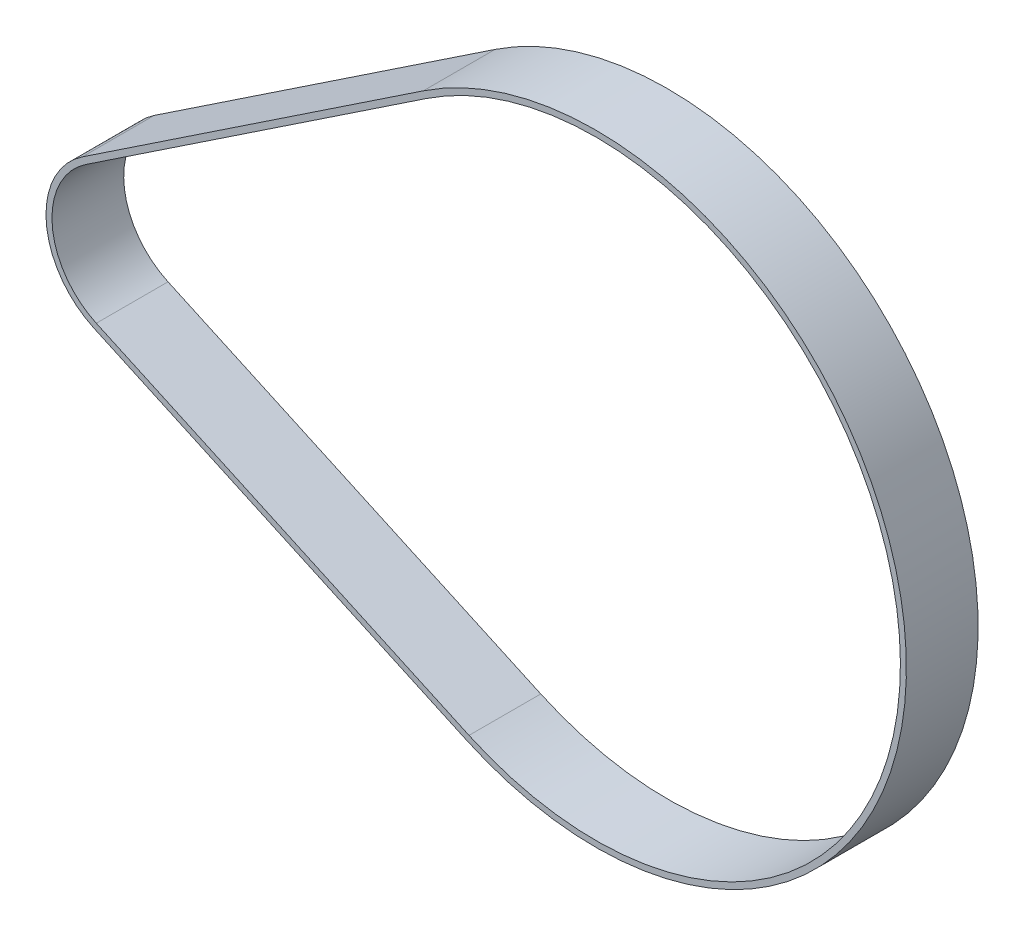
ISO-10303-21;
HEADER;
FILE_DESCRIPTION(('STEP AP214'),'2;1');
FILE_NAME('part.step','',(''),(''),'','','');
FILE_SCHEMA(('AUTOMOTIVE_DESIGN { 1 0 10303 214 1 1 1 1 }'));
ENDSEC;
DATA;
#1=APPLICATION_CONTEXT('core data for automotive mechanical design processes');
#2=APPLICATION_PROTOCOL_DEFINITION('international standard','automotive_design',2000,#1);
#3=PRODUCT_CONTEXT('',#1,'mechanical');
#4=PRODUCT('Part','Part','',(#3));
#5=PRODUCT_RELATED_PRODUCT_CATEGORY('part','',(#4));
#6=PRODUCT_DEFINITION_FORMATION('','',#4);
#7=PRODUCT_DEFINITION_CONTEXT('part definition',#1,'design');
#8=PRODUCT_DEFINITION('design','',#6,#7);
#9=PRODUCT_DEFINITION_SHAPE('','',#8);
#10=(LENGTH_UNIT() NAMED_UNIT(*) SI_UNIT(.MILLI.,.METRE.));
#11=(NAMED_UNIT(*) PLANE_ANGLE_UNIT() SI_UNIT($,.RADIAN.));
#12=(NAMED_UNIT(*) SI_UNIT($,.STERADIAN.) SOLID_ANGLE_UNIT());
#13=UNCERTAINTY_MEASURE_WITH_UNIT(LENGTH_MEASURE(1.E-05),#10,'distance_accuracy_value','');
#14=(GEOMETRIC_REPRESENTATION_CONTEXT(3) GLOBAL_UNCERTAINTY_ASSIGNED_CONTEXT((#13)) GLOBAL_UNIT_ASSIGNED_CONTEXT((#10,
#11,#12)) REPRESENTATION_CONTEXT('',''));
#15=CARTESIAN_POINT('',(0.,0.,0.));
#16=DIRECTION('',(0.,0.,1.));
#17=DIRECTION('',(1.,0.,0.));
#18=AXIS2_PLACEMENT_3D('',#15,#16,#17);
#19=CARTESIAN_POINT('',(0.,0.,-2.));
#20=DIRECTION('',(0.,0.,1.));
#21=DIRECTION('',(1.,0.,0.));
#22=AXIS2_PLACEMENT_3D('',#19,#20,#21);
#23=CYLINDRICAL_SURFACE('',#22,6.85);
#24=DIRECTION('',(0.,0.,1.));
#25=VECTOR('',#24,1.);
#26=CARTESIAN_POINT('',(-2.8504445756242,-6.22876117067388,-2.));
#27=LINE('',#26,#25);
#28=CARTESIAN_POINT('',(-2.8504445756242,-6.22876117067388,-2.));
#29=VERTEX_POINT('',#28);
#30=CARTESIAN_POINT('',(-2.8504445756242,-6.22876117067388,4.));
#31=VERTEX_POINT('',#30);
#32=EDGE_CURVE('E38',#29,#31,#27,.T.);
#33=ORIENTED_EDGE('',*,*,#32,.T.);
#34=CARTESIAN_POINT('',(0.,0.,4.));
#35=DIRECTION('',(0.,0.,1.));
#36=DIRECTION('',(1.,0.,0.));
#37=AXIS2_PLACEMENT_3D('',#34,#35,#36);
#38=CIRCLE('',#37,6.85);
#39=CARTESIAN_POINT('',(-3.80384633602262,5.69677567154678,4.));
#40=VERTEX_POINT('',#39);
#41=EDGE_CURVE('E130',#40,#31,#38,.T.);
#42=ORIENTED_EDGE('',*,*,#41,.F.);
#43=DIRECTION('',(0.,0.,1.));
#44=VECTOR('',#43,1.);
#45=CARTESIAN_POINT('',(-3.80384633602262,5.69677567154678,-2.));
#46=LINE('',#45,#44);
#47=CARTESIAN_POINT('',(-3.80384633602262,5.69677567154678,-2.));
#48=VERTEX_POINT('',#47);
#49=EDGE_CURVE('E11',#48,#40,#46,.T.);
#50=ORIENTED_EDGE('',*,*,#49,.F.);
#51=CARTESIAN_POINT('',(0.,0.,-2.));
#52=DIRECTION('',(0.,0.,1.));
#53=DIRECTION('',(1.,0.,0.));
#54=AXIS2_PLACEMENT_3D('',#51,#52,#53);
#55=CIRCLE('',#54,6.85);
#56=EDGE_CURVE('E149',#48,#29,#55,.T.);
#57=ORIENTED_EDGE('',*,*,#56,.T.);
#58=EDGE_LOOP('',(#33,#42,#50,#57));
#59=FACE_BOUND('',#58,.T.);
#60=ADVANCED_FACE('F35',(#59),#23,.T.);
#61=CARTESIAN_POINT('',(-3.80384633602262,5.69677567154678,-2.));
#62=DIRECTION('',(-0.555306034455858,0.831646083437486,0.));
#63=DIRECTION('',(-0.831646083437486,-0.555306034455858,0.));
#64=AXIS2_PLACEMENT_3D('',#61,#62,#63);
#65=PLANE('',#64);
#66=ORIENTED_EDGE('',*,*,#49,.T.);
#67=DIRECTION('',(-0.831646083437486,-0.555306034455858,0.));
#68=VECTOR('',#67,1.);
#69=CARTESIAN_POINT('',(-3.80384633602262,5.69677567154678,4.));
#70=LINE('',#69,#68);
#71=CARTESIAN_POINT('',(24.7082842646475,24.7348719159281,4.));
#72=VERTEX_POINT('',#71);
#73=EDGE_CURVE('E139',#72,#40,#70,.T.);
#74=ORIENTED_EDGE('',*,*,#73,.F.);
#75=DIRECTION('',(0.,0.,1.));
#76=VECTOR('',#75,1.);
#77=CARTESIAN_POINT('',(24.7082842646475,24.7348719159281,-2.));
#78=LINE('',#77,#76);
#79=CARTESIAN_POINT('',(24.7082842646475,24.7348719159281,-2.));
#80=VERTEX_POINT('',#79);
#81=EDGE_CURVE('E43',#80,#72,#78,.T.);
#82=ORIENTED_EDGE('',*,*,#81,.F.);
#83=DIRECTION('',(-0.831646083437486,-0.555306034455858,0.));
#84=VECTOR('',#83,1.);
#85=CARTESIAN_POINT('',(-3.80384633602262,5.69677567154678,-2.));
#86=LINE('',#85,#84);
#87=EDGE_CURVE('E160',#80,#48,#86,.T.);
#88=ORIENTED_EDGE('',*,*,#87,.T.);
#89=EDGE_LOOP('',(#66,#74,#82,#88));
#90=FACE_BOUND('',#89,.T.);
#91=ADVANCED_FACE('F172',(#90),#65,.T.);
#92=CARTESIAN_POINT('',(39.1351350398107,3.12870666822224,-2.));
#93=DIRECTION('',(0.,0.,1.));
#94=DIRECTION('',(1.,0.,0.));
#95=AXIS2_PLACEMENT_3D('',#92,#93,#94);
#96=CYLINDRICAL_SURFACE('',#95,25.98);
#97=ORIENTED_EDGE('',*,*,#81,.T.);
#98=CARTESIAN_POINT('',(39.1351350398107,3.12870666822224,4.));
#99=DIRECTION('',(0.,0.,1.));
#100=DIRECTION('',(1.,0.,0.));
#101=AXIS2_PLACEMENT_3D('',#98,#99,#100);
#102=CIRCLE('',#101,25.98);
#103=CARTESIAN_POINT('',(28.3242518172243,-20.4951203703336,4.));
#104=VERTEX_POINT('',#103);
#105=EDGE_CURVE('E136',#104,#72,#102,.T.);
#106=ORIENTED_EDGE('',*,*,#105,.F.);
#107=DIRECTION('',(0.,0.,1.));
#108=VECTOR('',#107,1.);
#109=CARTESIAN_POINT('',(28.3242518172243,-20.4951203703336,-2.));
#110=LINE('',#109,#108);
#111=CARTESIAN_POINT('',(28.3242518172243,-20.4951203703336,-2.));
#112=VERTEX_POINT('',#111);
#113=EDGE_CURVE('E163',#112,#104,#110,.T.);
#114=ORIENTED_EDGE('',*,*,#113,.F.);
#115=CARTESIAN_POINT('',(39.1351350398107,3.12870666822224,-2.));
#116=DIRECTION('',(0.,0.,1.));
#117=DIRECTION('',(1.,0.,0.));
#118=AXIS2_PLACEMENT_3D('',#115,#116,#117);
#119=CIRCLE('',#118,25.98);
#120=EDGE_CURVE('E157',#112,#80,#119,.T.);
#121=ORIENTED_EDGE('',*,*,#120,.T.);
#122=EDGE_LOOP('',(#97,#106,#114,#121));
#123=FACE_BOUND('',#122,.T.);
#124=ADVANCED_FACE('F178',(#123),#96,.T.);
#125=CARTESIAN_POINT('',(28.3242518172243,-20.4951203703336,-2.));
#126=DIRECTION('',(-0.416123295711562,-0.909308200098376,0.));
#127=DIRECTION('',(0.909308200098376,-0.416123295711562,0.));
#128=AXIS2_PLACEMENT_3D('',#125,#126,#127);
#129=PLANE('',#128);
#130=ORIENTED_EDGE('',*,*,#113,.T.);
#131=DIRECTION('',(0.909308200098376,-0.416123295711562,0.));
#132=VECTOR('',#131,1.);
#133=CARTESIAN_POINT('',(28.3242518172243,-20.4951203703336,4.));
#134=LINE('',#133,#132);
#135=EDGE_CURVE('E133',#31,#104,#134,.T.);
#136=ORIENTED_EDGE('',*,*,#135,.F.);
#137=ORIENTED_EDGE('',*,*,#32,.F.);
#138=DIRECTION('',(0.909308200098376,-0.416123295711562,0.));
#139=VECTOR('',#138,1.);
#140=CARTESIAN_POINT('',(28.3242518172243,-20.4951203703336,-2.));
#141=LINE('',#140,#139);
#142=EDGE_CURVE('E154',#29,#112,#141,.T.);
#143=ORIENTED_EDGE('',*,*,#142,.T.);
#144=EDGE_LOOP('',(#130,#136,#137,#143));
#145=FACE_BOUND('',#144,.T.);
#146=ADVANCED_FACE('F167',(#145),#129,.T.);
#147=CARTESIAN_POINT('',(0.,0.,-2.));
#148=DIRECTION('',(0.,0.,1.));
#149=DIRECTION('',(1.,0.,0.));
#150=AXIS2_PLACEMENT_3D('',#147,#148,#149);
#151=PLANE('',#150);
#152=DIRECTION('',(-0.831646083437486,-0.555306034455858,0.));
#153=VECTOR('',#152,1.);
#154=CARTESIAN_POINT('',(-3.5261933187947,5.28095262982803,-2.));
#155=LINE('',#154,#153);
#156=CARTESIAN_POINT('',(24.9859372818755,24.3190488742094,-2.));
#157=VERTEX_POINT('',#156);
#158=CARTESIAN_POINT('',(-3.5261933187947,5.28095262982803,-2.));
#159=VERTEX_POINT('',#158);
#160=EDGE_CURVE('E112',#157,#159,#155,.T.);
#161=ORIENTED_EDGE('',*,*,#160,.T.);
#162=CARTESIAN_POINT('',(0.,0.,-2.));
#163=DIRECTION('',(0.,0.,1.));
#164=DIRECTION('',(1.,0.,0.));
#165=AXIS2_PLACEMENT_3D('',#162,#163,#164);
#166=CIRCLE('',#165,6.35);
#167=CARTESIAN_POINT('',(-2.64238292776841,-5.77410707062469,-2.));
#168=VERTEX_POINT('',#167);
#169=EDGE_CURVE('E142',#159,#168,#166,.T.);
#170=ORIENTED_EDGE('',*,*,#169,.T.);
#171=DIRECTION('',(0.909308200098376,-0.416123295711562,0.));
#172=VECTOR('',#171,1.);
#173=CARTESIAN_POINT('',(28.5323134650801,-20.0404662702844,-2.));
#174=LINE('',#173,#172);
#175=CARTESIAN_POINT('',(28.5323134650801,-20.0404662702844,-2.));
#176=VERTEX_POINT('',#175);
#177=EDGE_CURVE('E107',#168,#176,#174,.T.);
#178=ORIENTED_EDGE('',*,*,#177,.T.);
#179=CARTESIAN_POINT('',(39.1351350398107,3.12870666822224,-2.));
#180=DIRECTION('',(0.,0.,1.));
#181=DIRECTION('',(1.,0.,0.));
#182=AXIS2_PLACEMENT_3D('',#179,#180,#181);
#183=CIRCLE('',#182,25.48);
#184=EDGE_CURVE('E51',#176,#157,#183,.T.);
#185=ORIENTED_EDGE('',*,*,#184,.T.);
#186=EDGE_LOOP('',(#161,#170,#178,#185));
#187=FACE_BOUND('',#186,.T.);
#188=ORIENTED_EDGE('',*,*,#56,.F.);
#189=ORIENTED_EDGE('',*,*,#87,.F.);
#190=ORIENTED_EDGE('',*,*,#120,.F.);
#191=ORIENTED_EDGE('',*,*,#142,.F.);
#192=EDGE_LOOP('',(#188,#189,#190,#191));
#193=FACE_BOUND('',#192,.T.);
#194=ADVANCED_FACE('F176',(#187,#193),#151,.F.);
#195=CARTESIAN_POINT('',(0.,0.,-2.));
#196=DIRECTION('',(0.,0.,1.));
#197=DIRECTION('',(1.,0.,0.));
#198=AXIS2_PLACEMENT_3D('',#195,#196,#197);
#199=CYLINDRICAL_SURFACE('',#198,6.35);
#200=DIRECTION('',(0.,0.,1.));
#201=VECTOR('',#200,1.);
#202=CARTESIAN_POINT('',(-3.5261933187947,5.28095262982803,-2.));
#203=LINE('',#202,#201);
#204=CARTESIAN_POINT('',(-3.5261933187947,5.28095262982803,4.));
#205=VERTEX_POINT('',#204);
#206=EDGE_CURVE('E117',#159,#205,#203,.T.);
#207=ORIENTED_EDGE('',*,*,#206,.T.);
#208=CARTESIAN_POINT('',(0.,0.,4.));
#209=DIRECTION('',(0.,0.,1.));
#210=DIRECTION('',(1.,0.,0.));
#211=AXIS2_PLACEMENT_3D('',#208,#209,#210);
#212=CIRCLE('',#211,6.35);
#213=CARTESIAN_POINT('',(-2.64238292776841,-5.77410707062469,4.));
#214=VERTEX_POINT('',#213);
#215=EDGE_CURVE('E115',#205,#214,#212,.T.);
#216=ORIENTED_EDGE('',*,*,#215,.T.);
#217=DIRECTION('',(0.,0.,1.));
#218=VECTOR('',#217,1.);
#219=CARTESIAN_POINT('',(-2.64238292776841,-5.77410707062469,-2.));
#220=LINE('',#219,#218);
#221=EDGE_CURVE('E100',#168,#214,#220,.T.);
#222=ORIENTED_EDGE('',*,*,#221,.F.);
#223=ORIENTED_EDGE('',*,*,#169,.F.);
#224=EDGE_LOOP('',(#207,#216,#222,#223));
#225=FACE_BOUND('',#224,.T.);
#226=ADVANCED_FACE('F116',(#225),#199,.F.);
#227=CARTESIAN_POINT('',(-3.5261933187947,5.28095262982803,-2.));
#228=DIRECTION('',(-0.555306034455858,0.831646083437486,0.));
#229=DIRECTION('',(-0.831646083437486,-0.555306034455858,0.));
#230=AXIS2_PLACEMENT_3D('',#227,#228,#229);
#231=PLANE('',#230);
#232=DIRECTION('',(0.,0.,1.));
#233=VECTOR('',#232,1.);
#234=CARTESIAN_POINT('',(24.9859372818755,24.3190488742094,-2.));
#235=LINE('',#234,#233);
#236=CARTESIAN_POINT('',(24.9859372818755,24.3190488742094,4.));
#237=VERTEX_POINT('',#236);
#238=EDGE_CURVE('E150',#157,#237,#235,.T.);
#239=ORIENTED_EDGE('',*,*,#238,.T.);
#240=DIRECTION('',(-0.831646083437486,-0.555306034455858,0.));
#241=VECTOR('',#240,1.);
#242=CARTESIAN_POINT('',(-3.5261933187947,5.28095262982803,4.));
#243=LINE('',#242,#241);
#244=EDGE_CURVE('E126',#237,#205,#243,.T.);
#245=ORIENTED_EDGE('',*,*,#244,.T.);
#246=ORIENTED_EDGE('',*,*,#206,.F.);
#247=ORIENTED_EDGE('',*,*,#160,.F.);
#248=EDGE_LOOP('',(#239,#245,#246,#247));
#249=FACE_BOUND('',#248,.T.);
#250=ADVANCED_FACE('F221',(#249),#231,.F.);
#251=CARTESIAN_POINT('',(39.1351350398107,3.12870666822224,-2.));
#252=DIRECTION('',(0.,0.,1.));
#253=DIRECTION('',(1.,0.,0.));
#254=AXIS2_PLACEMENT_3D('',#251,#252,#253);
#255=CYLINDRICAL_SURFACE('',#254,25.48);
#256=DIRECTION('',(0.,0.,1.));
#257=VECTOR('',#256,1.);
#258=CARTESIAN_POINT('',(28.5323134650801,-20.0404662702844,-2.));
#259=LINE('',#258,#257);
#260=CARTESIAN_POINT('',(28.5323134650801,-20.0404662702844,4.));
#261=VERTEX_POINT('',#260);
#262=EDGE_CURVE('E111',#176,#261,#259,.T.);
#263=ORIENTED_EDGE('',*,*,#262,.T.);
#264=CARTESIAN_POINT('',(39.1351350398107,3.12870666822224,4.));
#265=DIRECTION('',(0.,0.,1.));
#266=DIRECTION('',(1.,0.,0.));
#267=AXIS2_PLACEMENT_3D('',#264,#265,#266);
#268=CIRCLE('',#267,25.48);
#269=EDGE_CURVE('E124',#261,#237,#268,.T.);
#270=ORIENTED_EDGE('',*,*,#269,.T.);
#271=ORIENTED_EDGE('',*,*,#238,.F.);
#272=ORIENTED_EDGE('',*,*,#184,.F.);
#273=EDGE_LOOP('',(#263,#270,#271,#272));
#274=FACE_BOUND('',#273,.T.);
#275=ADVANCED_FACE('F230',(#274),#255,.F.);
#276=CARTESIAN_POINT('',(28.5323134650801,-20.0404662702844,-2.));
#277=DIRECTION('',(-0.416123295711562,-0.909308200098376,0.));
#278=DIRECTION('',(0.909308200098376,-0.416123295711562,0.));
#279=AXIS2_PLACEMENT_3D('',#276,#277,#278);
#280=PLANE('',#279);
#281=ORIENTED_EDGE('',*,*,#221,.T.);
#282=DIRECTION('',(0.909308200098376,-0.416123295711562,0.));
#283=VECTOR('',#282,1.);
#284=CARTESIAN_POINT('',(28.5323134650801,-20.0404662702844,4.));
#285=LINE('',#284,#283);
#286=EDGE_CURVE('E104',#214,#261,#285,.T.);
#287=ORIENTED_EDGE('',*,*,#286,.T.);
#288=ORIENTED_EDGE('',*,*,#262,.F.);
#289=ORIENTED_EDGE('',*,*,#177,.F.);
#290=EDGE_LOOP('',(#281,#287,#288,#289));
#291=FACE_BOUND('',#290,.T.);
#292=ADVANCED_FACE('F102',(#291),#280,.F.);
#293=CARTESIAN_POINT('',(0.,0.,4.));
#294=DIRECTION('',(0.,0.,1.));
#295=DIRECTION('',(1.,0.,0.));
#296=AXIS2_PLACEMENT_3D('',#293,#294,#295);
#297=PLANE('',#296);
#298=ORIENTED_EDGE('',*,*,#41,.T.);
#299=ORIENTED_EDGE('',*,*,#135,.T.);
#300=ORIENTED_EDGE('',*,*,#105,.T.);
#301=ORIENTED_EDGE('',*,*,#73,.T.);
#302=EDGE_LOOP('',(#298,#299,#300,#301));
#303=FACE_BOUND('',#302,.T.);
#304=ORIENTED_EDGE('',*,*,#286,.F.);
#305=ORIENTED_EDGE('',*,*,#215,.F.);
#306=ORIENTED_EDGE('',*,*,#244,.F.);
#307=ORIENTED_EDGE('',*,*,#269,.F.);
#308=EDGE_LOOP('',(#304,#305,#306,#307));
#309=FACE_BOUND('',#308,.T.);
#310=ADVANCED_FACE('F122',(#303,#309),#297,.T.);
#311=CLOSED_SHELL('',(#60,#91,#124,#146,#194,#226,#250,#275,#292,#310));
#312=MANIFOLD_SOLID_BREP('B2',#311);
#313=ADVANCED_BREP_SHAPE_REPRESENTATION('',(#18,#312),#14);
#314=SHAPE_DEFINITION_REPRESENTATION(#9,#313);
ENDSEC;
END-ISO-10303-21;
